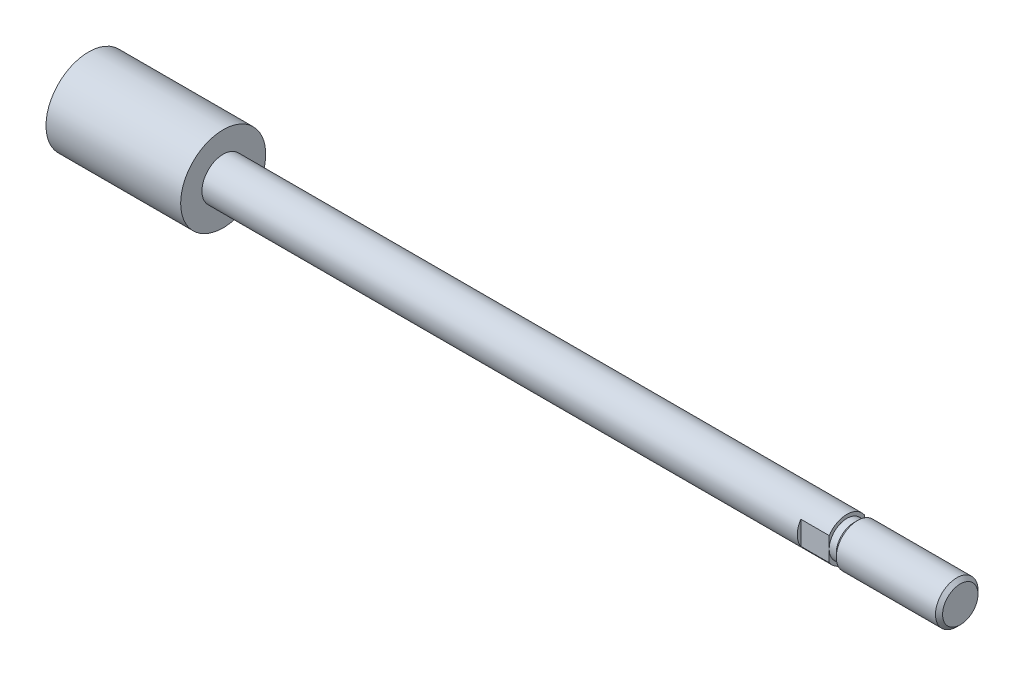
ISO-10303-21;
HEADER;
FILE_DESCRIPTION(('STEP AP214'),'2;1');
FILE_NAME('part.step','',(''),(''),'','','');
FILE_SCHEMA(('AUTOMOTIVE_DESIGN { 1 0 10303 214 1 1 1 1 }'));
ENDSEC;
DATA;
#1=APPLICATION_CONTEXT('core data for automotive mechanical design processes');
#2=APPLICATION_PROTOCOL_DEFINITION('international standard','automotive_design',2000,#1);
#3=PRODUCT_CONTEXT('',#1,'mechanical');
#4=PRODUCT('Part','Part','',(#3));
#5=PRODUCT_RELATED_PRODUCT_CATEGORY('part','',(#4));
#6=PRODUCT_DEFINITION_FORMATION('','',#4);
#7=PRODUCT_DEFINITION_CONTEXT('part definition',#1,'design');
#8=PRODUCT_DEFINITION('design','',#6,#7);
#9=PRODUCT_DEFINITION_SHAPE('','',#8);
#10=(LENGTH_UNIT() NAMED_UNIT(*) SI_UNIT(.MILLI.,.METRE.));
#11=(NAMED_UNIT(*) PLANE_ANGLE_UNIT() SI_UNIT($,.RADIAN.));
#12=(NAMED_UNIT(*) SI_UNIT($,.STERADIAN.) SOLID_ANGLE_UNIT());
#13=UNCERTAINTY_MEASURE_WITH_UNIT(LENGTH_MEASURE(1.E-05),#10,'distance_accuracy_value','');
#14=(GEOMETRIC_REPRESENTATION_CONTEXT(3) GLOBAL_UNCERTAINTY_ASSIGNED_CONTEXT((#13)) GLOBAL_UNIT_ASSIGNED_CONTEXT((#10,
#11,#12)) REPRESENTATION_CONTEXT('',''));
#15=CARTESIAN_POINT('',(0.,0.,0.));
#16=DIRECTION('',(0.,0.,1.));
#17=DIRECTION('',(1.,0.,0.));
#18=AXIS2_PLACEMENT_3D('',#15,#16,#17);
#19=CARTESIAN_POINT('',(-26.3911640481052,0.,0.));
#20=DIRECTION('',(-1.,0.,0.));
#21=DIRECTION('',(0.,0.,1.));
#22=AXIS2_PLACEMENT_3D('',#19,#20,#21);
#23=CYLINDRICAL_SURFACE('',#22,3.);
#24=CARTESIAN_POINT('',(19.,0.,0.));
#25=DIRECTION('',(-1.,0.,0.));
#26=DIRECTION('',(0.,0.,1.));
#27=AXIS2_PLACEMENT_3D('',#24,#25,#26);
#28=CIRCLE('',#27,3.);
#29=CARTESIAN_POINT('',(19.,0.,3.));
#30=VERTEX_POINT('',#29);
#31=EDGE_CURVE('E107',#30,#30,#28,.T.);
#32=ORIENTED_EDGE('',*,*,#31,.F.);
#33=EDGE_LOOP('',(#32));
#34=FACE_BOUND('',#33,.T.);
#35=CARTESIAN_POINT('',(103.,0.,0.));
#36=DIRECTION('',(1.,0.,0.));
#37=DIRECTION('',(0.,0.,-1.));
#38=AXIS2_PLACEMENT_3D('',#35,#36,#37);
#39=CIRCLE('',#38,3.);
#40=CARTESIAN_POINT('',(103.,1.6583123951777,-2.5));
#41=VERTEX_POINT('',#40);
#42=CARTESIAN_POINT('',(103.,-1.6583123951777,-2.5));
#43=VERTEX_POINT('',#42);
#44=EDGE_CURVE('E11',#41,#43,#39,.F.);
#45=ORIENTED_EDGE('',*,*,#44,.T.);
#46=DIRECTION('',(-1.,0.,0.));
#47=VECTOR('',#46,1.);
#48=CARTESIAN_POINT('',(-26.3911640481052,-1.6583123951777,-2.5));
#49=LINE('',#48,#47);
#50=CARTESIAN_POINT('',(107.,-1.65831239517769,-2.5));
#51=VERTEX_POINT('',#50);
#52=EDGE_CURVE('E89',#43,#51,#49,.F.);
#53=ORIENTED_EDGE('',*,*,#52,.T.);
#54=CARTESIAN_POINT('',(107.,0.,0.));
#55=DIRECTION('',(-1.,0.,0.));
#56=DIRECTION('',(0.,0.,1.));
#57=AXIS2_PLACEMENT_3D('',#54,#55,#56);
#58=CIRCLE('',#57,2.99999999999999);
#59=CARTESIAN_POINT('',(107.,-1.65831239517769,2.5));
#60=VERTEX_POINT('',#59);
#61=EDGE_CURVE('E97',#51,#60,#58,.T.);
#62=ORIENTED_EDGE('',*,*,#61,.T.);
#63=DIRECTION('',(-1.,0.,0.));
#64=VECTOR('',#63,1.);
#65=CARTESIAN_POINT('',(-26.3911640481052,-1.6583123951777,2.5));
#66=LINE('',#65,#64);
#67=CARTESIAN_POINT('',(103.,-1.6583123951777,2.5));
#68=VERTEX_POINT('',#67);
#69=EDGE_CURVE('E123',#68,#60,#66,.F.);
#70=ORIENTED_EDGE('',*,*,#69,.F.);
#71=CARTESIAN_POINT('',(103.,0.,0.));
#72=DIRECTION('',(1.,0.,0.));
#73=DIRECTION('',(0.,0.,-1.));
#74=AXIS2_PLACEMENT_3D('',#71,#72,#73);
#75=CIRCLE('',#74,3.);
#76=CARTESIAN_POINT('',(103.,1.6583123951777,2.5));
#77=VERTEX_POINT('',#76);
#78=EDGE_CURVE('E47',#68,#77,#75,.F.);
#79=ORIENTED_EDGE('',*,*,#78,.T.);
#80=DIRECTION('',(-1.,0.,0.));
#81=VECTOR('',#80,1.);
#82=CARTESIAN_POINT('',(-26.3911640481052,1.6583123951777,2.5));
#83=LINE('',#82,#81);
#84=CARTESIAN_POINT('',(107.,1.65831239517769,2.5));
#85=VERTEX_POINT('',#84);
#86=EDGE_CURVE('E121',#85,#77,#83,.T.);
#87=ORIENTED_EDGE('',*,*,#86,.F.);
#88=CARTESIAN_POINT('',(107.,1.65831239517769,-2.5));
#89=VERTEX_POINT('',#88);
#90=EDGE_CURVE('E103',#85,#89,#58,.T.);
#91=ORIENTED_EDGE('',*,*,#90,.T.);
#92=DIRECTION('',(-1.,0.,0.));
#93=VECTOR('',#92,1.);
#94=CARTESIAN_POINT('',(-26.3911640481052,1.6583123951777,-2.5));
#95=LINE('',#94,#93);
#96=EDGE_CURVE('E54',#89,#41,#95,.T.);
#97=ORIENTED_EDGE('',*,*,#96,.T.);
#98=EDGE_LOOP('',(#45,#53,#62,#70,#79,#87,#91,#97));
#99=FACE_BOUND('',#98,.T.);
#100=ADVANCED_FACE('F39',(#34,#99),#23,.T.);
#101=CARTESIAN_POINT('',(107.,-2.99999999999999,0.));
#102=DIRECTION('',(1.,0.,0.));
#103=DIRECTION('',(0.,0.,-1.));
#104=AXIS2_PLACEMENT_3D('',#101,#102,#103);
#105=PLANE('',#104);
#106=ORIENTED_EDGE('',*,*,#61,.F.);
#107=DIRECTION('',(0.,1.,0.));
#108=VECTOR('',#107,1.);
#109=CARTESIAN_POINT('',(107.,6.,-2.5));
#110=LINE('',#109,#108);
#111=CARTESIAN_POINT('',(107.,0.,-2.5));
#112=VERTEX_POINT('',#111);
#113=EDGE_CURVE('E86',#51,#112,#110,.T.);
#114=ORIENTED_EDGE('',*,*,#113,.T.);
#115=CARTESIAN_POINT('',(107.,0.,0.));
#116=DIRECTION('',(-1.,0.,0.));
#117=DIRECTION('',(0.,0.,1.));
#118=AXIS2_PLACEMENT_3D('',#115,#116,#117);
#119=CIRCLE('',#118,2.49999999999999);
#120=CARTESIAN_POINT('',(107.,0.,2.49999999999999));
#121=VERTEX_POINT('',#120);
#122=EDGE_CURVE('E62',#112,#121,#119,.T.);
#123=ORIENTED_EDGE('',*,*,#122,.T.);
#124=DIRECTION('',(0.,1.,0.));
#125=VECTOR('',#124,1.);
#126=CARTESIAN_POINT('',(107.,6.,2.5));
#127=LINE('',#126,#125);
#128=EDGE_CURVE('E102',#60,#121,#127,.T.);
#129=ORIENTED_EDGE('',*,*,#128,.F.);
#130=EDGE_LOOP('',(#106,#114,#123,#129));
#131=FACE_BOUND('',#130,.T.);
#132=ADVANCED_FACE('F101',(#131),#105,.T.);
#133=EDGE_CURVE('E104',#121,#112,#119,.T.);
#134=ORIENTED_EDGE('',*,*,#133,.T.);
#135=EDGE_CURVE('E91',#112,#89,#110,.T.);
#136=ORIENTED_EDGE('',*,*,#135,.T.);
#137=ORIENTED_EDGE('',*,*,#90,.F.);
#138=EDGE_CURVE('E99',#121,#85,#127,.T.);
#139=ORIENTED_EDGE('',*,*,#138,.F.);
#140=EDGE_LOOP('',(#134,#136,#137,#139));
#141=FACE_BOUND('',#140,.T.);
#142=ADVANCED_FACE('F172',(#141),#105,.T.);
#143=CARTESIAN_POINT('',(19.,-3.,0.));
#144=DIRECTION('',(1.,0.,0.));
#145=DIRECTION('',(0.,0.,-1.));
#146=AXIS2_PLACEMENT_3D('',#143,#144,#145);
#147=PLANE('',#146);
#148=ORIENTED_EDGE('',*,*,#31,.T.);
#149=EDGE_LOOP('',(#148));
#150=FACE_BOUND('',#149,.T.);
#151=CARTESIAN_POINT('',(19.,0.,0.));
#152=DIRECTION('',(-1.,0.,0.));
#153=DIRECTION('',(0.,0.,1.));
#154=AXIS2_PLACEMENT_3D('',#151,#152,#153);
#155=CIRCLE('',#154,6.);
#156=CARTESIAN_POINT('',(19.,0.,6.));
#157=VERTEX_POINT('',#156);
#158=EDGE_CURVE('E137',#157,#157,#155,.T.);
#159=ORIENTED_EDGE('',*,*,#158,.F.);
#160=EDGE_LOOP('',(#159));
#161=FACE_BOUND('',#160,.T.);
#162=ADVANCED_FACE('F164',(#150,#161),#147,.T.);
#163=CARTESIAN_POINT('',(-26.3911640481052,0.,0.));
#164=DIRECTION('',(-1.,0.,0.));
#165=DIRECTION('',(0.,0.,1.));
#166=AXIS2_PLACEMENT_3D('',#163,#164,#165);
#167=CYLINDRICAL_SURFACE('',#166,2.49999999999999);
#168=CARTESIAN_POINT('',(108.,0.,0.));
#169=DIRECTION('',(-1.,0.,0.));
#170=DIRECTION('',(0.,0.,1.));
#171=AXIS2_PLACEMENT_3D('',#168,#169,#170);
#172=CIRCLE('',#171,2.49999999999999);
#173=CARTESIAN_POINT('',(108.,0.,2.49999999999999));
#174=VERTEX_POINT('',#173);
#175=EDGE_CURVE('E145',#174,#174,#172,.T.);
#176=ORIENTED_EDGE('',*,*,#175,.T.);
#177=EDGE_LOOP('',(#176));
#178=FACE_BOUND('',#177,.T.);
#179=ORIENTED_EDGE('',*,*,#133,.F.);
#180=ORIENTED_EDGE('',*,*,#122,.F.);
#181=EDGE_LOOP('',(#179,#180));
#182=FACE_BOUND('',#181,.T.);
#183=ADVANCED_FACE('F149',(#178,#182),#167,.T.);
#184=CARTESIAN_POINT('',(108.,0.,0.));
#185=DIRECTION('',(1.,0.,0.));
#186=DIRECTION('',(0.,0.,-1.));
#187=AXIS2_PLACEMENT_3D('',#184,#185,#186);
#188=CONICAL_SURFACE('',#187,2.49999999999999,0.785398163397448);
#189=CARTESIAN_POINT('',(108.5,0.,0.));
#190=DIRECTION('',(-1.,0.,0.));
#191=DIRECTION('',(0.,0.,1.));
#192=AXIS2_PLACEMENT_3D('',#189,#190,#191);
#193=CIRCLE('',#192,2.99999999999999);
#194=CARTESIAN_POINT('',(108.5,0.,2.99999999999999));
#195=VERTEX_POINT('',#194);
#196=EDGE_CURVE('E143',#195,#195,#193,.T.);
#197=ORIENTED_EDGE('',*,*,#196,.T.);
#198=EDGE_LOOP('',(#197));
#199=FACE_BOUND('',#198,.T.);
#200=ORIENTED_EDGE('',*,*,#175,.F.);
#201=EDGE_LOOP('',(#200));
#202=FACE_BOUND('',#201,.T.);
#203=ADVANCED_FACE('F152',(#199,#202),#188,.T.);
#204=CARTESIAN_POINT('',(-26.3911640481052,0.,0.));
#205=DIRECTION('',(-1.,0.,0.));
#206=DIRECTION('',(0.,0.,1.));
#207=AXIS2_PLACEMENT_3D('',#204,#205,#206);
#208=CYLINDRICAL_SURFACE('',#207,2.99999999999999);
#209=CARTESIAN_POINT('',(122.5,0.,0.));
#210=DIRECTION('',(1.,0.,0.));
#211=DIRECTION('',(0.,0.,-1.));
#212=AXIS2_PLACEMENT_3D('',#209,#210,#211);
#213=CIRCLE('',#212,2.99999999999999);
#214=CARTESIAN_POINT('',(122.5,0.,-2.99999999999999));
#215=VERTEX_POINT('',#214);
#216=EDGE_CURVE('E114',#215,#215,#213,.F.);
#217=ORIENTED_EDGE('',*,*,#216,.T.);
#218=EDGE_LOOP('',(#217));
#219=FACE_BOUND('',#218,.T.);
#220=ORIENTED_EDGE('',*,*,#196,.F.);
#221=EDGE_LOOP('',(#220));
#222=FACE_BOUND('',#221,.T.);
#223=ADVANCED_FACE('F154',(#219,#222),#208,.T.);
#224=CARTESIAN_POINT('',(123.,-2.99999999999999,0.));
#225=DIRECTION('',(1.,0.,0.));
#226=DIRECTION('',(0.,0.,-1.));
#227=AXIS2_PLACEMENT_3D('',#224,#225,#226);
#228=PLANE('',#227);
#229=CARTESIAN_POINT('',(123.,0.,0.));
#230=DIRECTION('',(1.,0.,0.));
#231=DIRECTION('',(0.,0.,-1.));
#232=AXIS2_PLACEMENT_3D('',#229,#230,#231);
#233=CIRCLE('',#232,2.49999999999997);
#234=CARTESIAN_POINT('',(123.,0.,-2.49999999999997));
#235=VERTEX_POINT('',#234);
#236=EDGE_CURVE('E117',#235,#235,#233,.T.);
#237=ORIENTED_EDGE('',*,*,#236,.T.);
#238=EDGE_LOOP('',(#237));
#239=FACE_BOUND('',#238,.T.);
#240=ADVANCED_FACE('F161',(#239),#228,.T.);
#241=CARTESIAN_POINT('',(0.,-6.,0.));
#242=DIRECTION('',(-1.,0.,0.));
#243=DIRECTION('',(0.,0.,1.));
#244=AXIS2_PLACEMENT_3D('',#241,#242,#243);
#245=PLANE('',#244);
#246=CARTESIAN_POINT('',(0.,0.,0.));
#247=DIRECTION('',(-1.,0.,0.));
#248=DIRECTION('',(0.,0.,1.));
#249=AXIS2_PLACEMENT_3D('',#246,#247,#248);
#250=CIRCLE('',#249,6.);
#251=CARTESIAN_POINT('',(0.,0.,6.));
#252=VERTEX_POINT('',#251);
#253=EDGE_CURVE('E140',#252,#252,#250,.T.);
#254=ORIENTED_EDGE('',*,*,#253,.T.);
#255=EDGE_LOOP('',(#254));
#256=FACE_BOUND('',#255,.T.);
#257=ADVANCED_FACE('F187',(#256),#245,.T.);
#258=CARTESIAN_POINT('',(-26.3911640481052,0.,0.));
#259=DIRECTION('',(-1.,0.,0.));
#260=DIRECTION('',(0.,0.,1.));
#261=AXIS2_PLACEMENT_3D('',#258,#259,#260);
#262=CYLINDRICAL_SURFACE('',#261,6.);
#263=ORIENTED_EDGE('',*,*,#158,.T.);
#264=EDGE_LOOP('',(#263));
#265=FACE_BOUND('',#264,.T.);
#266=ORIENTED_EDGE('',*,*,#253,.F.);
#267=EDGE_LOOP('',(#266));
#268=FACE_BOUND('',#267,.T.);
#269=ADVANCED_FACE('F184',(#265,#268),#262,.T.);
#270=CARTESIAN_POINT('',(122.5,0.,0.));
#271=DIRECTION('',(-1.,0.,0.));
#272=DIRECTION('',(0.,0.,1.));
#273=AXIS2_PLACEMENT_3D('',#270,#271,#272);
#274=CONICAL_SURFACE('',#273,2.99999999999999,0.785398163397468);
#275=ORIENTED_EDGE('',*,*,#236,.F.);
#276=EDGE_LOOP('',(#275));
#277=FACE_BOUND('',#276,.T.);
#278=ORIENTED_EDGE('',*,*,#216,.F.);
#279=EDGE_LOOP('',(#278));
#280=FACE_BOUND('',#279,.T.);
#281=ADVANCED_FACE('F41',(#277,#280),#274,.T.);
#282=CARTESIAN_POINT('',(103.,6.,2.5));
#283=DIRECTION('',(0.,0.,-1.));
#284=DIRECTION('',(0.,1.,0.));
#285=AXIS2_PLACEMENT_3D('',#282,#283,#284);
#286=PLANE('',#285);
#287=ORIENTED_EDGE('',*,*,#69,.T.);
#288=ORIENTED_EDGE('',*,*,#128,.T.);
#289=ORIENTED_EDGE('',*,*,#138,.T.);
#290=ORIENTED_EDGE('',*,*,#86,.T.);
#291=DIRECTION('',(0.,1.,0.));
#292=VECTOR('',#291,1.);
#293=CARTESIAN_POINT('',(103.,6.,2.5));
#294=LINE('',#293,#292);
#295=EDGE_CURVE('E128',#68,#77,#294,.T.);
#296=ORIENTED_EDGE('',*,*,#295,.F.);
#297=EDGE_LOOP('',(#287,#288,#289,#290,#296));
#298=FACE_BOUND('',#297,.T.);
#299=ADVANCED_FACE('F130',(#298),#286,.F.);
#300=CARTESIAN_POINT('',(103.,-6.,6.));
#301=DIRECTION('',(1.,0.,0.));
#302=DIRECTION('',(0.,0.,-1.));
#303=AXIS2_PLACEMENT_3D('',#300,#301,#302);
#304=PLANE('',#303);
#305=ORIENTED_EDGE('',*,*,#295,.T.);
#306=ORIENTED_EDGE('',*,*,#78,.F.);
#307=EDGE_LOOP('',(#305,#306));
#308=FACE_BOUND('',#307,.T.);
#309=ADVANCED_FACE('F127',(#308),#304,.T.);
#310=CARTESIAN_POINT('',(103.,6.,-2.5));
#311=DIRECTION('',(0.,0.,-1.));
#312=DIRECTION('',(0.,1.,0.));
#313=AXIS2_PLACEMENT_3D('',#310,#311,#312);
#314=PLANE('',#313);
#315=DIRECTION('',(0.,1.,0.));
#316=VECTOR('',#315,1.);
#317=CARTESIAN_POINT('',(103.,6.,-2.5));
#318=LINE('',#317,#316);
#319=EDGE_CURVE('E93',#43,#41,#318,.T.);
#320=ORIENTED_EDGE('',*,*,#319,.T.);
#321=ORIENTED_EDGE('',*,*,#96,.F.);
#322=ORIENTED_EDGE('',*,*,#135,.F.);
#323=ORIENTED_EDGE('',*,*,#113,.F.);
#324=ORIENTED_EDGE('',*,*,#52,.F.);
#325=EDGE_LOOP('',(#320,#321,#322,#323,#324));
#326=FACE_BOUND('',#325,.T.);
#327=ADVANCED_FACE('F88',(#326),#314,.T.);
#328=CARTESIAN_POINT('',(103.,-6.,-6.));
#329=DIRECTION('',(1.,0.,0.));
#330=DIRECTION('',(0.,0.,1.));
#331=AXIS2_PLACEMENT_3D('',#328,#329,#330);
#332=PLANE('',#331);
#333=ORIENTED_EDGE('',*,*,#319,.F.);
#334=ORIENTED_EDGE('',*,*,#44,.F.);
#335=EDGE_LOOP('',(#333,#334));
#336=FACE_BOUND('',#335,.T.);
#337=ADVANCED_FACE('F205',(#336),#332,.T.);
#338=CLOSED_SHELL('',(#100,#132,#142,#162,#183,#203,#223,#240,#257,#269,#281,#299,#309,#327,#337));
#339=MANIFOLD_SOLID_BREP('B2',#338);
#340=ADVANCED_BREP_SHAPE_REPRESENTATION('',(#18,#339),#14);
#341=SHAPE_DEFINITION_REPRESENTATION(#9,#340);
ENDSEC;
END-ISO-10303-21;
